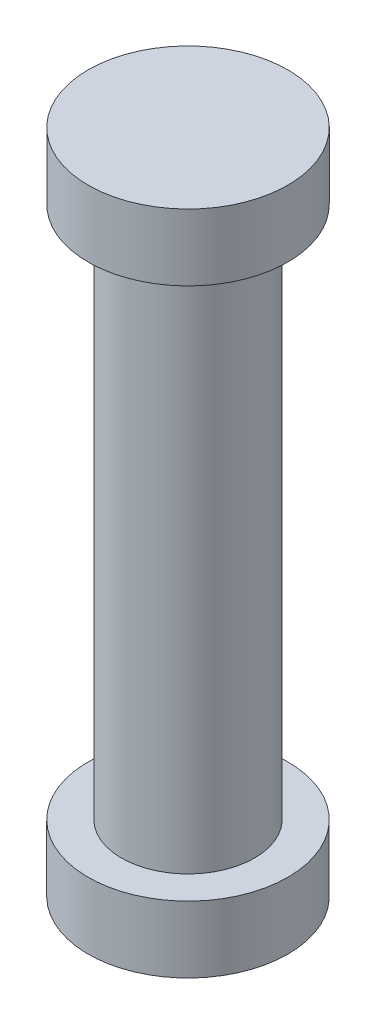
ISO-10303-21;
HEADER;
FILE_DESCRIPTION(('STEP AP214'),'2;1');
FILE_NAME('part.step','',(''),(''),'','','');
FILE_SCHEMA(('AUTOMOTIVE_DESIGN { 1 0 10303 214 1 1 1 1 }'));
ENDSEC;
DATA;
#1=APPLICATION_CONTEXT('core data for automotive mechanical design processes');
#2=APPLICATION_PROTOCOL_DEFINITION('international standard','automotive_design',2000,#1);
#3=PRODUCT_CONTEXT('',#1,'mechanical');
#4=PRODUCT('Part','Part','',(#3));
#5=PRODUCT_RELATED_PRODUCT_CATEGORY('part','',(#4));
#6=PRODUCT_DEFINITION_FORMATION('','',#4);
#7=PRODUCT_DEFINITION_CONTEXT('part definition',#1,'design');
#8=PRODUCT_DEFINITION('design','',#6,#7);
#9=PRODUCT_DEFINITION_SHAPE('','',#8);
#10=(LENGTH_UNIT() NAMED_UNIT(*) SI_UNIT(.MILLI.,.METRE.));
#11=(NAMED_UNIT(*) PLANE_ANGLE_UNIT() SI_UNIT($,.RADIAN.));
#12=(NAMED_UNIT(*) SI_UNIT($,.STERADIAN.) SOLID_ANGLE_UNIT());
#13=UNCERTAINTY_MEASURE_WITH_UNIT(LENGTH_MEASURE(1.E-05),#10,'distance_accuracy_value','');
#14=(GEOMETRIC_REPRESENTATION_CONTEXT(3) GLOBAL_UNCERTAINTY_ASSIGNED_CONTEXT((#13)) GLOBAL_UNIT_ASSIGNED_CONTEXT((#10,
#11,#12)) REPRESENTATION_CONTEXT('',''));
#15=CARTESIAN_POINT('',(0.,0.,0.));
#16=DIRECTION('',(0.,0.,1.));
#17=DIRECTION('',(1.,0.,0.));
#18=AXIS2_PLACEMENT_3D('',#15,#16,#17);
#19=CARTESIAN_POINT('',(0.,-20.,0.));
#20=DIRECTION('',(0.,1.,0.));
#21=DIRECTION('',(-1.,0.,0.));
#22=AXIS2_PLACEMENT_3D('',#19,#20,#21);
#23=CYLINDRICAL_SURFACE('',#22,2.5);
#24=CARTESIAN_POINT('',(0.,-20.,0.));
#25=DIRECTION('',(0.,-1.,0.));
#26=DIRECTION('',(1.,0.,0.));
#27=AXIS2_PLACEMENT_3D('',#24,#25,#26);
#28=CIRCLE('',#27,2.5);
#29=CARTESIAN_POINT('',(2.5,-20.,0.));
#30=VERTEX_POINT('',#29);
#31=EDGE_CURVE('E10',#30,#30,#28,.T.);
#32=ORIENTED_EDGE('',*,*,#31,.F.);
#33=EDGE_LOOP('',(#32));
#34=FACE_BOUND('',#33,.T.);
#35=CARTESIAN_POINT('',(0.,0.,0.));
#36=DIRECTION('',(0.,-1.,0.));
#37=DIRECTION('',(1.,0.,0.));
#38=AXIS2_PLACEMENT_3D('',#35,#36,#37);
#39=CIRCLE('',#38,2.5);
#40=CARTESIAN_POINT('',(2.5,0.,0.));
#41=VERTEX_POINT('',#40);
#42=EDGE_CURVE('E22',#41,#41,#39,.T.);
#43=ORIENTED_EDGE('',*,*,#42,.T.);
#44=EDGE_LOOP('',(#43));
#45=FACE_BOUND('',#44,.T.);
#46=ADVANCED_FACE('F15',(#34,#45),#23,.T.);
#47=CARTESIAN_POINT('',(0.,-22.5,0.));
#48=DIRECTION('',(0.,1.,0.));
#49=DIRECTION('',(-1.,0.,0.));
#50=AXIS2_PLACEMENT_3D('',#47,#48,#49);
#51=CYLINDRICAL_SURFACE('',#50,3.75);
#52=CARTESIAN_POINT('',(0.,-22.5,0.));
#53=DIRECTION('',(0.,-1.,0.));
#54=DIRECTION('',(1.,0.,0.));
#55=AXIS2_PLACEMENT_3D('',#52,#53,#54);
#56=CIRCLE('',#55,3.75);
#57=CARTESIAN_POINT('',(3.75,-22.5,0.));
#58=VERTEX_POINT('',#57);
#59=EDGE_CURVE('E29',#58,#58,#56,.T.);
#60=ORIENTED_EDGE('',*,*,#59,.F.);
#61=EDGE_LOOP('',(#60));
#62=FACE_BOUND('',#61,.T.);
#63=CARTESIAN_POINT('',(0.,-20.,0.));
#64=DIRECTION('',(0.,-1.,0.));
#65=DIRECTION('',(1.,0.,0.));
#66=AXIS2_PLACEMENT_3D('',#63,#64,#65);
#67=CIRCLE('',#66,3.75);
#68=CARTESIAN_POINT('',(3.75,-20.,0.));
#69=VERTEX_POINT('',#68);
#70=EDGE_CURVE('E35',#69,#69,#67,.T.);
#71=ORIENTED_EDGE('',*,*,#70,.T.);
#72=EDGE_LOOP('',(#71));
#73=FACE_BOUND('',#72,.T.);
#74=ADVANCED_FACE('F66',(#62,#73),#51,.T.);
#75=CARTESIAN_POINT('',(0.,-22.5,0.));
#76=DIRECTION('',(0.,-1.,0.));
#77=DIRECTION('',(1.,0.,0.));
#78=AXIS2_PLACEMENT_3D('',#75,#76,#77);
#79=PLANE('',#78);
#80=ORIENTED_EDGE('',*,*,#59,.T.);
#81=EDGE_LOOP('',(#80));
#82=FACE_BOUND('',#81,.T.);
#83=ADVANCED_FACE('F71',(#82),#79,.T.);
#84=CARTESIAN_POINT('',(0.,-20.,0.));
#85=DIRECTION('',(0.,-1.,0.));
#86=DIRECTION('',(1.,0.,0.));
#87=AXIS2_PLACEMENT_3D('',#84,#85,#86);
#88=PLANE('',#87);
#89=ORIENTED_EDGE('',*,*,#31,.T.);
#90=EDGE_LOOP('',(#89));
#91=FACE_BOUND('',#90,.T.);
#92=ORIENTED_EDGE('',*,*,#70,.F.);
#93=EDGE_LOOP('',(#92));
#94=FACE_BOUND('',#93,.T.);
#95=ADVANCED_FACE('F76',(#91,#94),#88,.F.);
#96=CARTESIAN_POINT('',(0.,2.5,0.));
#97=DIRECTION('',(0.,-1.,0.));
#98=DIRECTION('',(1.,0.,0.));
#99=AXIS2_PLACEMENT_3D('',#96,#97,#98);
#100=CYLINDRICAL_SURFACE('',#99,3.75);
#101=CARTESIAN_POINT('',(0.,2.5,0.));
#102=DIRECTION('',(0.,1.,0.));
#103=DIRECTION('',(-1.,0.,0.));
#104=AXIS2_PLACEMENT_3D('',#101,#102,#103);
#105=CIRCLE('',#104,3.75);
#106=CARTESIAN_POINT('',(-3.75,2.5,0.));
#107=VERTEX_POINT('',#106);
#108=EDGE_CURVE('E41',#107,#107,#105,.T.);
#109=ORIENTED_EDGE('',*,*,#108,.F.);
#110=EDGE_LOOP('',(#109));
#111=FACE_BOUND('',#110,.T.);
#112=CARTESIAN_POINT('',(0.,0.,0.));
#113=DIRECTION('',(0.,1.,0.));
#114=DIRECTION('',(-1.,0.,0.));
#115=AXIS2_PLACEMENT_3D('',#112,#113,#114);
#116=CIRCLE('',#115,3.75);
#117=CARTESIAN_POINT('',(-3.75,0.,0.));
#118=VERTEX_POINT('',#117);
#119=EDGE_CURVE('E45',#118,#118,#116,.T.);
#120=ORIENTED_EDGE('',*,*,#119,.T.);
#121=EDGE_LOOP('',(#120));
#122=FACE_BOUND('',#121,.T.);
#123=ADVANCED_FACE('F52',(#111,#122),#100,.T.);
#124=CARTESIAN_POINT('',(0.,2.5,0.));
#125=DIRECTION('',(0.,1.,0.));
#126=DIRECTION('',(-1.,0.,0.));
#127=AXIS2_PLACEMENT_3D('',#124,#125,#126);
#128=PLANE('',#127);
#129=ORIENTED_EDGE('',*,*,#108,.T.);
#130=EDGE_LOOP('',(#129));
#131=FACE_BOUND('',#130,.T.);
#132=ADVANCED_FACE('F56',(#131),#128,.T.);
#133=CARTESIAN_POINT('',(0.,0.,0.));
#134=DIRECTION('',(0.,1.,0.));
#135=DIRECTION('',(-1.,0.,0.));
#136=AXIS2_PLACEMENT_3D('',#133,#134,#135);
#137=PLANE('',#136);
#138=ORIENTED_EDGE('',*,*,#42,.F.);
#139=EDGE_LOOP('',(#138));
#140=FACE_BOUND('',#139,.T.);
#141=ORIENTED_EDGE('',*,*,#119,.F.);
#142=EDGE_LOOP('',(#141));
#143=FACE_BOUND('',#142,.T.);
#144=ADVANCED_FACE('F54',(#140,#143),#137,.F.);
#145=CLOSED_SHELL('',(#46,#74,#83,#95,#123,#132,#144));
#146=MANIFOLD_SOLID_BREP('B1',#145);
#147=ADVANCED_BREP_SHAPE_REPRESENTATION('',(#18,#146),#14);
#148=SHAPE_DEFINITION_REPRESENTATION(#9,#147);
ENDSEC;
END-ISO-10303-21;
